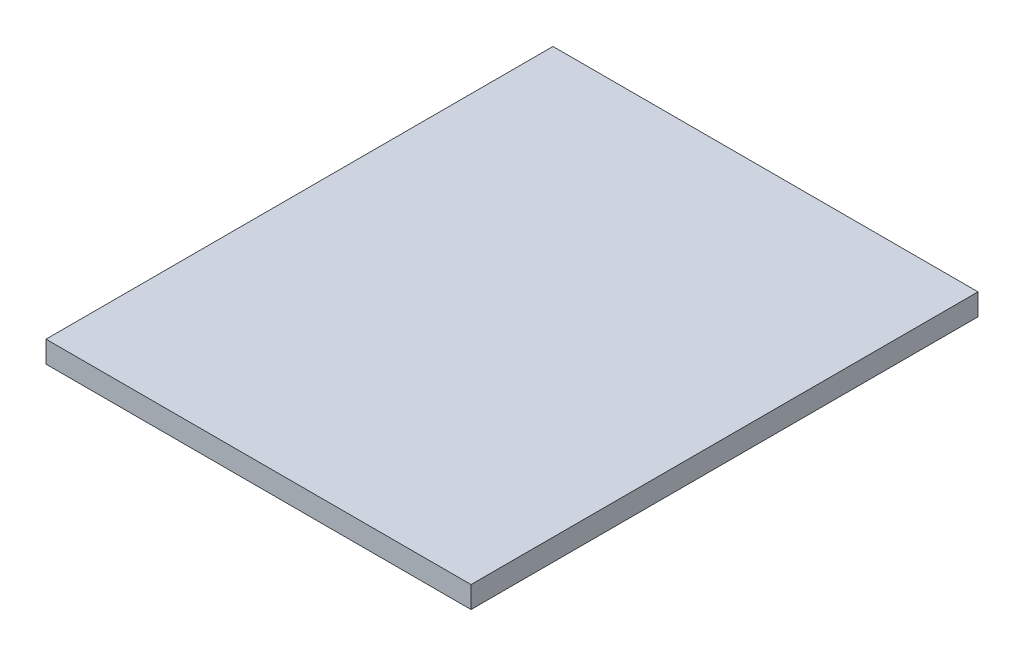
ISO-10303-21;
HEADER;
FILE_DESCRIPTION(('STEP AP214'),'2;1');
FILE_NAME('part.step','',(''),(''),'','','');
FILE_SCHEMA(('AUTOMOTIVE_DESIGN { 1 0 10303 214 1 1 1 1 }'));
ENDSEC;
DATA;
#1=APPLICATION_CONTEXT('core data for automotive mechanical design processes');
#2=APPLICATION_PROTOCOL_DEFINITION('international standard','automotive_design',2000,#1);
#3=PRODUCT_CONTEXT('',#1,'mechanical');
#4=PRODUCT('Part','Part','',(#3));
#5=PRODUCT_RELATED_PRODUCT_CATEGORY('part','',(#4));
#6=PRODUCT_DEFINITION_FORMATION('','',#4);
#7=PRODUCT_DEFINITION_CONTEXT('part definition',#1,'design');
#8=PRODUCT_DEFINITION('design','',#6,#7);
#9=PRODUCT_DEFINITION_SHAPE('','',#8);
#10=(LENGTH_UNIT() NAMED_UNIT(*) SI_UNIT(.MILLI.,.METRE.));
#11=(NAMED_UNIT(*) PLANE_ANGLE_UNIT() SI_UNIT($,.RADIAN.));
#12=(NAMED_UNIT(*) SI_UNIT($,.STERADIAN.) SOLID_ANGLE_UNIT());
#13=UNCERTAINTY_MEASURE_WITH_UNIT(LENGTH_MEASURE(1.E-05),#10,'distance_accuracy_value','');
#14=(GEOMETRIC_REPRESENTATION_CONTEXT(3) GLOBAL_UNCERTAINTY_ASSIGNED_CONTEXT((#13)) GLOBAL_UNIT_ASSIGNED_CONTEXT((#10,
#11,#12)) REPRESENTATION_CONTEXT('',''));
#15=CARTESIAN_POINT('',(0.,0.,0.));
#16=DIRECTION('',(0.,0.,1.));
#17=DIRECTION('',(1.,0.,0.));
#18=AXIS2_PLACEMENT_3D('',#15,#16,#17);
#19=CARTESIAN_POINT('',(0.,1.56,0.));
#20=DIRECTION('',(0.,0.,-1.));
#21=DIRECTION('',(-1.,0.,0.));
#22=AXIS2_PLACEMENT_3D('',#19,#20,#21);
#23=PLANE('',#22);
#24=DIRECTION('',(1.,0.,0.));
#25=VECTOR('',#24,1.);
#26=CARTESIAN_POINT('',(0.,0.,0.));
#27=LINE('',#26,#25);
#28=CARTESIAN_POINT('',(0.,0.,0.));
#29=VERTEX_POINT('',#28);
#30=CARTESIAN_POINT('',(30.6,0.,0.));
#31=VERTEX_POINT('',#30);
#32=EDGE_CURVE('E96',#29,#31,#27,.T.);
#33=ORIENTED_EDGE('',*,*,#32,.T.);
#34=DIRECTION('',(0.,-1.,0.));
#35=VECTOR('',#34,1.);
#36=CARTESIAN_POINT('',(30.6,1.56,0.));
#37=LINE('',#36,#35);
#38=CARTESIAN_POINT('',(30.6,1.56,0.));
#39=VERTEX_POINT('',#38);
#40=EDGE_CURVE('E11',#39,#31,#37,.T.);
#41=ORIENTED_EDGE('',*,*,#40,.F.);
#42=DIRECTION('',(1.,0.,0.));
#43=VECTOR('',#42,1.);
#44=CARTESIAN_POINT('',(0.,1.56,0.));
#45=LINE('',#44,#43);
#46=CARTESIAN_POINT('',(0.,1.56,0.));
#47=VERTEX_POINT('',#46);
#48=EDGE_CURVE('E82',#47,#39,#45,.T.);
#49=ORIENTED_EDGE('',*,*,#48,.F.);
#50=DIRECTION('',(0.,-1.,0.));
#51=VECTOR('',#50,1.);
#52=CARTESIAN_POINT('',(0.,1.56,0.));
#53=LINE('',#52,#51);
#54=EDGE_CURVE('E49',#47,#29,#53,.T.);
#55=ORIENTED_EDGE('',*,*,#54,.T.);
#56=EDGE_LOOP('',(#33,#41,#49,#55));
#57=FACE_BOUND('',#56,.T.);
#58=ADVANCED_FACE('F33',(#57),#23,.F.);
#59=CARTESIAN_POINT('',(30.6,1.56,0.));
#60=DIRECTION('',(-1.,0.,0.));
#61=DIRECTION('',(0.,0.,1.));
#62=AXIS2_PLACEMENT_3D('',#59,#60,#61);
#63=PLANE('',#62);
#64=DIRECTION('',(0.,0.,-1.));
#65=VECTOR('',#64,1.);
#66=CARTESIAN_POINT('',(30.6,0.,0.));
#67=LINE('',#66,#65);
#68=CARTESIAN_POINT('',(30.6,0.,-36.5));
#69=VERTEX_POINT('',#68);
#70=EDGE_CURVE('E87',#31,#69,#67,.T.);
#71=ORIENTED_EDGE('',*,*,#70,.T.);
#72=DIRECTION('',(0.,-1.,0.));
#73=VECTOR('',#72,1.);
#74=CARTESIAN_POINT('',(30.6,1.56,-36.5));
#75=LINE('',#74,#73);
#76=CARTESIAN_POINT('',(30.6,1.56,-36.5));
#77=VERTEX_POINT('',#76);
#78=EDGE_CURVE('E41',#77,#69,#75,.T.);
#79=ORIENTED_EDGE('',*,*,#78,.F.);
#80=DIRECTION('',(0.,0.,-1.));
#81=VECTOR('',#80,1.);
#82=CARTESIAN_POINT('',(30.6,1.56,0.));
#83=LINE('',#82,#81);
#84=EDGE_CURVE('E74',#39,#77,#83,.T.);
#85=ORIENTED_EDGE('',*,*,#84,.F.);
#86=ORIENTED_EDGE('',*,*,#40,.T.);
#87=EDGE_LOOP('',(#71,#79,#85,#86));
#88=FACE_BOUND('',#87,.T.);
#89=ADVANCED_FACE('F86',(#88),#63,.F.);
#90=CARTESIAN_POINT('',(0.,1.56,-36.5));
#91=DIRECTION('',(0.,0.,-1.));
#92=DIRECTION('',(-1.,0.,0.));
#93=AXIS2_PLACEMENT_3D('',#90,#91,#92);
#94=PLANE('',#93);
#95=DIRECTION('',(1.,0.,0.));
#96=VECTOR('',#95,1.);
#97=CARTESIAN_POINT('',(0.,0.,-36.5));
#98=LINE('',#97,#96);
#99=CARTESIAN_POINT('',(0.,0.,-36.5));
#100=VERTEX_POINT('',#99);
#101=EDGE_CURVE('E99',#100,#69,#98,.T.);
#102=ORIENTED_EDGE('',*,*,#101,.F.);
#103=DIRECTION('',(0.,-1.,0.));
#104=VECTOR('',#103,1.);
#105=CARTESIAN_POINT('',(0.,1.56,-36.5));
#106=LINE('',#105,#104);
#107=CARTESIAN_POINT('',(0.,1.56,-36.5));
#108=VERTEX_POINT('',#107);
#109=EDGE_CURVE('E63',#108,#100,#106,.T.);
#110=ORIENTED_EDGE('',*,*,#109,.F.);
#111=DIRECTION('',(1.,0.,0.));
#112=VECTOR('',#111,1.);
#113=CARTESIAN_POINT('',(0.,1.56,-36.5));
#114=LINE('',#113,#112);
#115=EDGE_CURVE('E81',#108,#77,#114,.T.);
#116=ORIENTED_EDGE('',*,*,#115,.T.);
#117=ORIENTED_EDGE('',*,*,#78,.T.);
#118=EDGE_LOOP('',(#102,#110,#116,#117));
#119=FACE_BOUND('',#118,.T.);
#120=ADVANCED_FACE('F90',(#119),#94,.T.);
#121=CARTESIAN_POINT('',(0.,1.56,0.));
#122=DIRECTION('',(-1.,0.,0.));
#123=DIRECTION('',(0.,0.,1.));
#124=AXIS2_PLACEMENT_3D('',#121,#122,#123);
#125=PLANE('',#124);
#126=DIRECTION('',(0.,0.,-1.));
#127=VECTOR('',#126,1.);
#128=CARTESIAN_POINT('',(0.,0.,0.));
#129=LINE('',#128,#127);
#130=EDGE_CURVE('E101',#29,#100,#129,.T.);
#131=ORIENTED_EDGE('',*,*,#130,.F.);
#132=ORIENTED_EDGE('',*,*,#54,.F.);
#133=DIRECTION('',(0.,0.,-1.));
#134=VECTOR('',#133,1.);
#135=CARTESIAN_POINT('',(0.,1.56,0.));
#136=LINE('',#135,#134);
#137=EDGE_CURVE('E91',#47,#108,#136,.T.);
#138=ORIENTED_EDGE('',*,*,#137,.T.);
#139=ORIENTED_EDGE('',*,*,#109,.T.);
#140=EDGE_LOOP('',(#131,#132,#138,#139));
#141=FACE_BOUND('',#140,.T.);
#142=ADVANCED_FACE('F107',(#141),#125,.T.);
#143=CARTESIAN_POINT('',(0.,1.56,0.));
#144=DIRECTION('',(0.,1.,0.));
#145=DIRECTION('',(0.,0.,1.));
#146=AXIS2_PLACEMENT_3D('',#143,#144,#145);
#147=PLANE('',#146);
#148=ORIENTED_EDGE('',*,*,#48,.T.);
#149=ORIENTED_EDGE('',*,*,#84,.T.);
#150=ORIENTED_EDGE('',*,*,#115,.F.);
#151=ORIENTED_EDGE('',*,*,#137,.F.);
#152=EDGE_LOOP('',(#148,#149,#150,#151));
#153=FACE_BOUND('',#152,.T.);
#154=ADVANCED_FACE('F78',(#153),#147,.T.);
#155=CARTESIAN_POINT('',(0.,0.,0.));
#156=DIRECTION('',(0.,1.,0.));
#157=DIRECTION('',(0.,0.,1.));
#158=AXIS2_PLACEMENT_3D('',#155,#156,#157);
#159=PLANE('',#158);
#160=ORIENTED_EDGE('',*,*,#32,.F.);
#161=ORIENTED_EDGE('',*,*,#130,.T.);
#162=ORIENTED_EDGE('',*,*,#101,.T.);
#163=ORIENTED_EDGE('',*,*,#70,.F.);
#164=EDGE_LOOP('',(#160,#161,#162,#163));
#165=FACE_BOUND('',#164,.T.);
#166=ADVANCED_FACE('F106',(#165),#159,.F.);
#167=CLOSED_SHELL('',(#58,#89,#120,#142,#154,#166));
#168=MANIFOLD_SOLID_BREP('B2',#167);
#169=ADVANCED_BREP_SHAPE_REPRESENTATION('',(#18,#168),#14);
#170=SHAPE_DEFINITION_REPRESENTATION(#9,#169);
ENDSEC;
END-ISO-10303-21;
